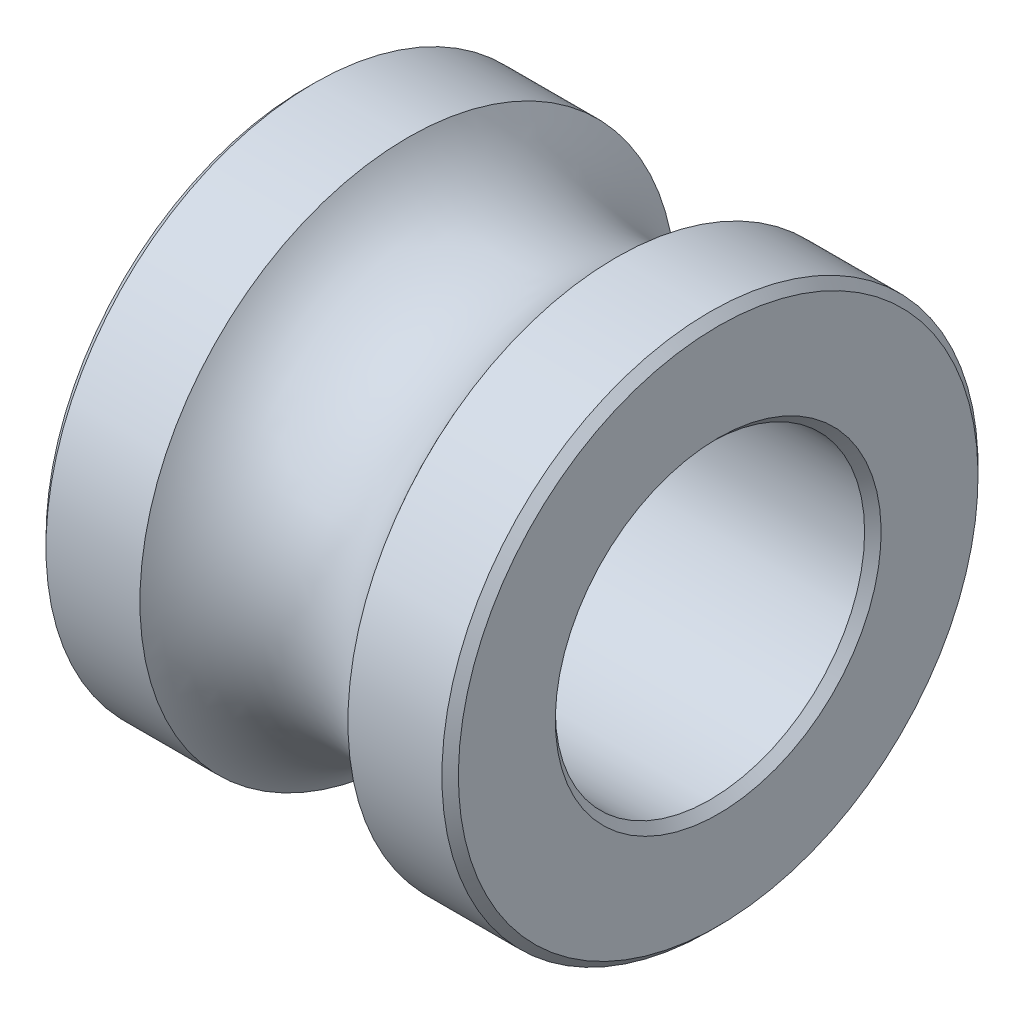
ISO-10303-21;
HEADER;
FILE_DESCRIPTION(('STEP AP214'),'2;1');
FILE_NAME('part.step','',(''),(''),'','','');
FILE_SCHEMA(('AUTOMOTIVE_DESIGN { 1 0 10303 214 1 1 1 1 }'));
ENDSEC;
DATA;
#1=APPLICATION_CONTEXT('core data for automotive mechanical design processes');
#2=APPLICATION_PROTOCOL_DEFINITION('international standard','automotive_design',2000,#1);
#3=PRODUCT_CONTEXT('',#1,'mechanical');
#4=PRODUCT('Part','Part','',(#3));
#5=PRODUCT_RELATED_PRODUCT_CATEGORY('part','',(#4));
#6=PRODUCT_DEFINITION_FORMATION('','',#4);
#7=PRODUCT_DEFINITION_CONTEXT('part definition',#1,'design');
#8=PRODUCT_DEFINITION('design','',#6,#7);
#9=PRODUCT_DEFINITION_SHAPE('','',#8);
#10=(LENGTH_UNIT() NAMED_UNIT(*) SI_UNIT(.MILLI.,.METRE.));
#11=(NAMED_UNIT(*) PLANE_ANGLE_UNIT() SI_UNIT($,.RADIAN.));
#12=(NAMED_UNIT(*) SI_UNIT($,.STERADIAN.) SOLID_ANGLE_UNIT());
#13=UNCERTAINTY_MEASURE_WITH_UNIT(LENGTH_MEASURE(1.E-05),#10,'distance_accuracy_value','');
#14=(GEOMETRIC_REPRESENTATION_CONTEXT(3) GLOBAL_UNCERTAINTY_ASSIGNED_CONTEXT((#13)) GLOBAL_UNIT_ASSIGNED_CONTEXT((#10,
#11,#12)) REPRESENTATION_CONTEXT('',''));
#15=CARTESIAN_POINT('',(0.,0.,0.));
#16=DIRECTION('',(0.,0.,1.));
#17=DIRECTION('',(1.,0.,0.));
#18=AXIS2_PLACEMENT_3D('',#15,#16,#17);
#19=CARTESIAN_POINT('',(-6.42901749222422,0.,0.));
#20=DIRECTION('',(-1.,0.,0.));
#21=DIRECTION('',(0.,-1.,0.));
#22=AXIS2_PLACEMENT_3D('',#19,#20,#21);
#23=CYLINDRICAL_SURFACE('',#22,1.5);
#24=CARTESIAN_POINT('',(-1.92,0.,0.));
#25=DIRECTION('',(-1.,0.,0.));
#26=DIRECTION('',(0.,-1.,0.));
#27=AXIS2_PLACEMENT_3D('',#24,#25,#26);
#28=CIRCLE('',#27,1.5);
#29=CARTESIAN_POINT('',(-1.92,-1.5,0.));
#30=VERTEX_POINT('',#29);
#31=EDGE_CURVE('E59',#30,#30,#28,.T.);
#32=ORIENTED_EDGE('',*,*,#31,.T.);
#33=EDGE_LOOP('',(#32));
#34=FACE_BOUND('',#33,.T.);
#35=CARTESIAN_POINT('',(1.92,0.,0.));
#36=DIRECTION('',(1.,0.,0.));
#37=DIRECTION('',(0.,1.,0.));
#38=AXIS2_PLACEMENT_3D('',#35,#36,#37);
#39=CIRCLE('',#38,1.5);
#40=CARTESIAN_POINT('',(1.92,1.5,0.));
#41=VERTEX_POINT('',#40);
#42=EDGE_CURVE('E62',#41,#41,#39,.T.);
#43=ORIENTED_EDGE('',*,*,#42,.T.);
#44=EDGE_LOOP('',(#43));
#45=FACE_BOUND('',#44,.T.);
#46=ADVANCED_FACE('F33',(#34,#45),#23,.F.);
#47=CARTESIAN_POINT('',(2.,-1.5,0.));
#48=DIRECTION('',(1.,0.,0.));
#49=DIRECTION('',(0.,1.,0.));
#50=AXIS2_PLACEMENT_3D('',#47,#48,#49);
#51=PLANE('',#50);
#52=CARTESIAN_POINT('',(2.,0.,0.));
#53=DIRECTION('',(1.,0.,0.));
#54=DIRECTION('',(0.,1.,0.));
#55=AXIS2_PLACEMENT_3D('',#52,#53,#54);
#56=CIRCLE('',#55,2.52);
#57=CARTESIAN_POINT('',(2.,2.52,0.));
#58=VERTEX_POINT('',#57);
#59=EDGE_CURVE('E10',#58,#58,#56,.T.);
#60=ORIENTED_EDGE('',*,*,#59,.T.);
#61=EDGE_LOOP('',(#60));
#62=FACE_BOUND('',#61,.T.);
#63=CARTESIAN_POINT('',(2.,0.,0.));
#64=DIRECTION('',(1.,0.,0.));
#65=DIRECTION('',(0.,1.,0.));
#66=AXIS2_PLACEMENT_3D('',#63,#64,#65);
#67=CIRCLE('',#66,1.58);
#68=CARTESIAN_POINT('',(2.,1.58,0.));
#69=VERTEX_POINT('',#68);
#70=EDGE_CURVE('E40',#69,#69,#67,.F.);
#71=ORIENTED_EDGE('',*,*,#70,.T.);
#72=EDGE_LOOP('',(#71));
#73=FACE_BOUND('',#72,.T.);
#74=ADVANCED_FACE('F86',(#62,#73),#51,.T.);
#75=CARTESIAN_POINT('',(-6.42901749222422,0.,0.));
#76=DIRECTION('',(-1.,0.,0.));
#77=DIRECTION('',(0.,-1.,0.));
#78=AXIS2_PLACEMENT_3D('',#75,#76,#77);
#79=CYLINDRICAL_SURFACE('',#78,2.6);
#80=CARTESIAN_POINT('',(1.91999999999999,0.,0.));
#81=DIRECTION('',(1.,0.,0.));
#82=DIRECTION('',(0.,1.,0.));
#83=AXIS2_PLACEMENT_3D('',#80,#81,#82);
#84=CIRCLE('',#83,2.6);
#85=CARTESIAN_POINT('',(1.91999999999999,2.6,0.));
#86=VERTEX_POINT('',#85);
#87=EDGE_CURVE('E44',#86,#86,#84,.F.);
#88=ORIENTED_EDGE('',*,*,#87,.T.);
#89=EDGE_LOOP('',(#88));
#90=FACE_BOUND('',#89,.T.);
#91=CARTESIAN_POINT('',(1.0087120500916,0.,0.));
#92=DIRECTION('',(-1.,0.,0.));
#93=DIRECTION('',(0.,-1.,0.));
#94=AXIS2_PLACEMENT_3D('',#91,#92,#93);
#95=CIRCLE('',#94,2.6);
#96=CARTESIAN_POINT('',(1.0087120500916,-2.6,0.));
#97=VERTEX_POINT('',#96);
#98=EDGE_CURVE('E65',#97,#97,#95,.T.);
#99=ORIENTED_EDGE('',*,*,#98,.F.);
#100=EDGE_LOOP('',(#99));
#101=FACE_BOUND('',#100,.T.);
#102=ADVANCED_FACE('F76',(#90,#101),#79,.T.);
#103=CARTESIAN_POINT('',(0.,0.,0.));
#104=DIRECTION('',(-1.,0.,0.));
#105=DIRECTION('',(0.,-1.,0.));
#106=AXIS2_PLACEMENT_3D('',#103,#104,#105);
#107=TOROIDAL_SURFACE('',#106,3.25,1.2);
#108=ORIENTED_EDGE('',*,*,#98,.T.);
#109=EDGE_LOOP('',(#108));
#110=FACE_BOUND('',#109,.T.);
#111=CARTESIAN_POINT('',(-1.0087120500916,0.,0.));
#112=DIRECTION('',(-1.,0.,0.));
#113=DIRECTION('',(0.,-1.,0.));
#114=AXIS2_PLACEMENT_3D('',#111,#112,#113);
#115=CIRCLE('',#114,2.6);
#116=CARTESIAN_POINT('',(-1.0087120500916,-2.6,0.));
#117=VERTEX_POINT('',#116);
#118=EDGE_CURVE('E68',#117,#117,#115,.T.);
#119=ORIENTED_EDGE('',*,*,#118,.F.);
#120=EDGE_LOOP('',(#119));
#121=FACE_BOUND('',#120,.T.);
#122=ADVANCED_FACE('F74',(#110,#121),#107,.F.);
#123=CARTESIAN_POINT('',(-6.42901749222422,0.,0.));
#124=DIRECTION('',(-1.,0.,0.));
#125=DIRECTION('',(0.,-1.,0.));
#126=AXIS2_PLACEMENT_3D('',#123,#124,#125);
#127=CYLINDRICAL_SURFACE('',#126,2.6);
#128=CARTESIAN_POINT('',(-1.92,0.,0.));
#129=DIRECTION('',(-1.,0.,0.));
#130=DIRECTION('',(0.,-1.,0.));
#131=AXIS2_PLACEMENT_3D('',#128,#129,#130);
#132=CIRCLE('',#131,2.6);
#133=CARTESIAN_POINT('',(-1.92,-2.6,0.));
#134=VERTEX_POINT('',#133);
#135=EDGE_CURVE('E48',#134,#134,#132,.F.);
#136=ORIENTED_EDGE('',*,*,#135,.T.);
#137=EDGE_LOOP('',(#136));
#138=FACE_BOUND('',#137,.T.);
#139=ORIENTED_EDGE('',*,*,#118,.T.);
#140=EDGE_LOOP('',(#139));
#141=FACE_BOUND('',#140,.T.);
#142=ADVANCED_FACE('F72',(#138,#141),#127,.T.);
#143=CARTESIAN_POINT('',(-2.,-1.5,0.));
#144=DIRECTION('',(-1.,0.,0.));
#145=DIRECTION('',(0.,-1.,0.));
#146=AXIS2_PLACEMENT_3D('',#143,#144,#145);
#147=PLANE('',#146);
#148=CARTESIAN_POINT('',(-2.,0.,0.));
#149=DIRECTION('',(-1.,0.,0.));
#150=DIRECTION('',(0.,-1.,0.));
#151=AXIS2_PLACEMENT_3D('',#148,#149,#150);
#152=CIRCLE('',#151,1.58);
#153=CARTESIAN_POINT('',(-2.,-1.58,0.));
#154=VERTEX_POINT('',#153);
#155=EDGE_CURVE('E53',#154,#154,#152,.F.);
#156=ORIENTED_EDGE('',*,*,#155,.T.);
#157=EDGE_LOOP('',(#156));
#158=FACE_BOUND('',#157,.T.);
#159=CARTESIAN_POINT('',(-2.,0.,0.));
#160=DIRECTION('',(-1.,0.,0.));
#161=DIRECTION('',(0.,-1.,0.));
#162=AXIS2_PLACEMENT_3D('',#159,#160,#161);
#163=CIRCLE('',#162,2.52);
#164=CARTESIAN_POINT('',(-2.,-2.52,0.));
#165=VERTEX_POINT('',#164);
#166=EDGE_CURVE('E56',#165,#165,#163,.T.);
#167=ORIENTED_EDGE('',*,*,#166,.T.);
#168=EDGE_LOOP('',(#167));
#169=FACE_BOUND('',#168,.T.);
#170=ADVANCED_FACE('F83',(#158,#169),#147,.T.);
#171=CARTESIAN_POINT('',(-1.92,0.,0.));
#172=DIRECTION('',(-1.,0.,0.));
#173=DIRECTION('',(0.,-1.,0.));
#174=AXIS2_PLACEMENT_3D('',#171,#172,#173);
#175=CONICAL_SURFACE('',#174,1.5,0.785398163397455);
#176=ORIENTED_EDGE('',*,*,#155,.F.);
#177=EDGE_LOOP('',(#176));
#178=FACE_BOUND('',#177,.T.);
#179=ORIENTED_EDGE('',*,*,#31,.F.);
#180=EDGE_LOOP('',(#179));
#181=FACE_BOUND('',#180,.T.);
#182=ADVANCED_FACE('F98',(#178,#181),#175,.F.);
#183=CARTESIAN_POINT('',(-2.,0.,0.));
#184=DIRECTION('',(1.,0.,0.));
#185=DIRECTION('',(0.,1.,0.));
#186=AXIS2_PLACEMENT_3D('',#183,#184,#185);
#187=CONICAL_SURFACE('',#186,2.52,0.78539816339744);
#188=ORIENTED_EDGE('',*,*,#135,.F.);
#189=EDGE_LOOP('',(#188));
#190=FACE_BOUND('',#189,.T.);
#191=ORIENTED_EDGE('',*,*,#166,.F.);
#192=EDGE_LOOP('',(#191));
#193=FACE_BOUND('',#192,.T.);
#194=ADVANCED_FACE('F101',(#190,#193),#187,.T.);
#195=CARTESIAN_POINT('',(1.91999999999999,0.,0.));
#196=DIRECTION('',(-1.,0.,0.));
#197=DIRECTION('',(0.,-1.,0.));
#198=AXIS2_PLACEMENT_3D('',#195,#196,#197);
#199=CONICAL_SURFACE('',#198,2.6,0.785398163397448);
#200=ORIENTED_EDGE('',*,*,#59,.F.);
#201=EDGE_LOOP('',(#200));
#202=FACE_BOUND('',#201,.T.);
#203=ORIENTED_EDGE('',*,*,#87,.F.);
#204=EDGE_LOOP('',(#203));
#205=FACE_BOUND('',#204,.T.);
#206=ADVANCED_FACE('F104',(#202,#205),#199,.T.);
#207=CARTESIAN_POINT('',(2.,0.,0.));
#208=DIRECTION('',(1.,0.,0.));
#209=DIRECTION('',(0.,1.,0.));
#210=AXIS2_PLACEMENT_3D('',#207,#208,#209);
#211=CONICAL_SURFACE('',#210,1.58,0.785398163397444);
#212=ORIENTED_EDGE('',*,*,#42,.F.);
#213=EDGE_LOOP('',(#212));
#214=FACE_BOUND('',#213,.T.);
#215=ORIENTED_EDGE('',*,*,#70,.F.);
#216=EDGE_LOOP('',(#215));
#217=FACE_BOUND('',#216,.T.);
#218=ADVANCED_FACE('F35',(#214,#217),#211,.F.);
#219=CLOSED_SHELL('',(#46,#74,#102,#122,#142,#170,#182,#194,#206,#218));
#220=MANIFOLD_SOLID_BREP('B2',#219);
#221=ADVANCED_BREP_SHAPE_REPRESENTATION('',(#18,#220),#14);
#222=SHAPE_DEFINITION_REPRESENTATION(#9,#221);
ENDSEC;
END-ISO-10303-21;
